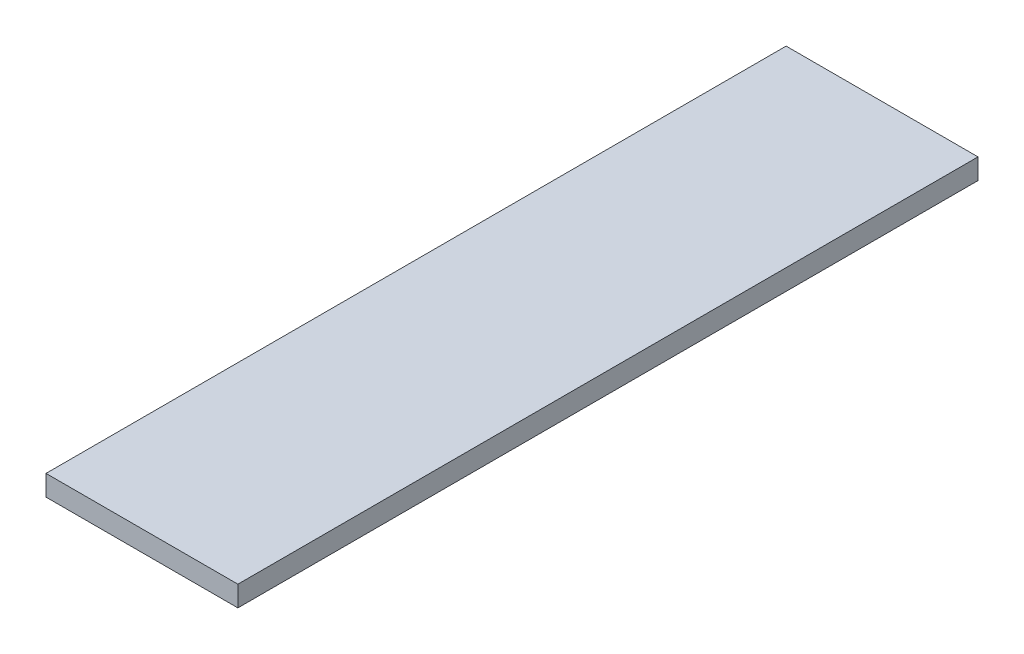
ISO-10303-21;
HEADER;
FILE_DESCRIPTION(('STEP AP214'),'2;1');
FILE_NAME('part.step','',(''),(''),'','','');
FILE_SCHEMA(('AUTOMOTIVE_DESIGN { 1 0 10303 214 1 1 1 1 }'));
ENDSEC;
DATA;
#1=APPLICATION_CONTEXT('core data for automotive mechanical design processes');
#2=APPLICATION_PROTOCOL_DEFINITION('international standard','automotive_design',2000,#1);
#3=PRODUCT_CONTEXT('',#1,'mechanical');
#4=PRODUCT('Part','Part','',(#3));
#5=PRODUCT_RELATED_PRODUCT_CATEGORY('part','',(#4));
#6=PRODUCT_DEFINITION_FORMATION('','',#4);
#7=PRODUCT_DEFINITION_CONTEXT('part definition',#1,'design');
#8=PRODUCT_DEFINITION('design','',#6,#7);
#9=PRODUCT_DEFINITION_SHAPE('','',#8);
#10=(LENGTH_UNIT() NAMED_UNIT(*) SI_UNIT(.MILLI.,.METRE.));
#11=(NAMED_UNIT(*) PLANE_ANGLE_UNIT() SI_UNIT($,.RADIAN.));
#12=(NAMED_UNIT(*) SI_UNIT($,.STERADIAN.) SOLID_ANGLE_UNIT());
#13=UNCERTAINTY_MEASURE_WITH_UNIT(LENGTH_MEASURE(1.E-05),#10,'distance_accuracy_value','');
#14=(GEOMETRIC_REPRESENTATION_CONTEXT(3) GLOBAL_UNCERTAINTY_ASSIGNED_CONTEXT((#13)) GLOBAL_UNIT_ASSIGNED_CONTEXT((#10,
#11,#12)) REPRESENTATION_CONTEXT('',''));
#15=CARTESIAN_POINT('',(0.,0.,0.));
#16=DIRECTION('',(0.,0.,1.));
#17=DIRECTION('',(1.,0.,0.));
#18=AXIS2_PLACEMENT_3D('',#15,#16,#17);
#19=CARTESIAN_POINT('',(88.8999999999999,19.05,-342.9));
#20=DIRECTION('',(-1.,0.,0.));
#21=DIRECTION('',(0.,0.,1.));
#22=AXIS2_PLACEMENT_3D('',#19,#20,#21);
#23=PLANE('',#22);
#24=DIRECTION('',(0.,0.,-1.));
#25=VECTOR('',#24,1.);
#26=CARTESIAN_POINT('',(88.8999999999999,0.,-342.9));
#27=LINE('',#26,#25);
#28=CARTESIAN_POINT('',(88.9,0.,342.9));
#29=VERTEX_POINT('',#28);
#30=CARTESIAN_POINT('',(88.8999999999999,0.,-342.9));
#31=VERTEX_POINT('',#30);
#32=EDGE_CURVE('E97',#29,#31,#27,.T.);
#33=ORIENTED_EDGE('',*,*,#32,.T.);
#34=DIRECTION('',(0.,-1.,0.));
#35=VECTOR('',#34,1.);
#36=CARTESIAN_POINT('',(88.8999999999999,19.05,-342.9));
#37=LINE('',#36,#35);
#38=CARTESIAN_POINT('',(88.8999999999999,19.05,-342.9));
#39=VERTEX_POINT('',#38);
#40=EDGE_CURVE('E11',#39,#31,#37,.T.);
#41=ORIENTED_EDGE('',*,*,#40,.F.);
#42=DIRECTION('',(0.,0.,-1.));
#43=VECTOR('',#42,1.);
#44=CARTESIAN_POINT('',(88.8999999999999,19.05,-342.9));
#45=LINE('',#44,#43);
#46=CARTESIAN_POINT('',(88.9,19.05,342.9));
#47=VERTEX_POINT('',#46);
#48=EDGE_CURVE('E85',#47,#39,#45,.T.);
#49=ORIENTED_EDGE('',*,*,#48,.F.);
#50=DIRECTION('',(0.,-1.,0.));
#51=VECTOR('',#50,1.);
#52=CARTESIAN_POINT('',(88.9,19.05,342.9));
#53=LINE('',#52,#51);
#54=EDGE_CURVE('E93',#47,#29,#53,.T.);
#55=ORIENTED_EDGE('',*,*,#54,.T.);
#56=EDGE_LOOP('',(#33,#41,#49,#55));
#57=FACE_BOUND('',#56,.T.);
#58=ADVANCED_FACE('F34',(#57),#23,.F.);
#59=CARTESIAN_POINT('',(-88.9,19.05,-342.9));
#60=DIRECTION('',(0.,0.,1.));
#61=DIRECTION('',(1.,0.,0.));
#62=AXIS2_PLACEMENT_3D('',#59,#60,#61);
#63=PLANE('',#62);
#64=DIRECTION('',(-1.,0.,0.));
#65=VECTOR('',#64,1.);
#66=CARTESIAN_POINT('',(-88.9,0.,-342.9));
#67=LINE('',#66,#65);
#68=CARTESIAN_POINT('',(-88.9,0.,-342.9));
#69=VERTEX_POINT('',#68);
#70=EDGE_CURVE('E89',#31,#69,#67,.T.);
#71=ORIENTED_EDGE('',*,*,#70,.T.);
#72=DIRECTION('',(0.,-1.,0.));
#73=VECTOR('',#72,1.);
#74=CARTESIAN_POINT('',(-88.9,19.05,-342.9));
#75=LINE('',#74,#73);
#76=CARTESIAN_POINT('',(-88.9,19.05,-342.9));
#77=VERTEX_POINT('',#76);
#78=EDGE_CURVE('E42',#77,#69,#75,.T.);
#79=ORIENTED_EDGE('',*,*,#78,.F.);
#80=DIRECTION('',(-1.,0.,0.));
#81=VECTOR('',#80,1.);
#82=CARTESIAN_POINT('',(-88.9,19.05,-342.9));
#83=LINE('',#82,#81);
#84=EDGE_CURVE('E80',#39,#77,#83,.T.);
#85=ORIENTED_EDGE('',*,*,#84,.F.);
#86=ORIENTED_EDGE('',*,*,#40,.T.);
#87=EDGE_LOOP('',(#71,#79,#85,#86));
#88=FACE_BOUND('',#87,.T.);
#89=ADVANCED_FACE('F88',(#88),#63,.F.);
#90=CARTESIAN_POINT('',(-88.9,19.05,-342.9));
#91=DIRECTION('',(1.,0.,0.));
#92=DIRECTION('',(0.,0.,-1.));
#93=AXIS2_PLACEMENT_3D('',#90,#91,#92);
#94=PLANE('',#93);
#95=DIRECTION('',(0.,0.,1.));
#96=VECTOR('',#95,1.);
#97=CARTESIAN_POINT('',(-88.9,0.,-342.9));
#98=LINE('',#97,#96);
#99=CARTESIAN_POINT('',(-88.8999999999999,0.,342.9));
#100=VERTEX_POINT('',#99);
#101=EDGE_CURVE('E67',#69,#100,#98,.T.);
#102=ORIENTED_EDGE('',*,*,#101,.T.);
#103=DIRECTION('',(0.,-1.,0.));
#104=VECTOR('',#103,1.);
#105=CARTESIAN_POINT('',(-88.8999999999999,19.05,342.9));
#106=LINE('',#105,#104);
#107=CARTESIAN_POINT('',(-88.8999999999999,19.05,342.9));
#108=VERTEX_POINT('',#107);
#109=EDGE_CURVE('E90',#108,#100,#106,.T.);
#110=ORIENTED_EDGE('',*,*,#109,.F.);
#111=DIRECTION('',(0.,0.,1.));
#112=VECTOR('',#111,1.);
#113=CARTESIAN_POINT('',(-88.9,19.05,-342.9));
#114=LINE('',#113,#112);
#115=EDGE_CURVE('E83',#77,#108,#114,.T.);
#116=ORIENTED_EDGE('',*,*,#115,.F.);
#117=ORIENTED_EDGE('',*,*,#78,.T.);
#118=EDGE_LOOP('',(#102,#110,#116,#117));
#119=FACE_BOUND('',#118,.T.);
#120=ADVANCED_FACE('F91',(#119),#94,.F.);
#121=CARTESIAN_POINT('',(-88.8999999999999,19.05,342.9));
#122=DIRECTION('',(0.,0.,-1.));
#123=DIRECTION('',(-1.,0.,0.));
#124=AXIS2_PLACEMENT_3D('',#121,#122,#123);
#125=PLANE('',#124);
#126=DIRECTION('',(1.,0.,0.));
#127=VECTOR('',#126,1.);
#128=CARTESIAN_POINT('',(-88.8999999999999,0.,342.9));
#129=LINE('',#128,#127);
#130=EDGE_CURVE('E73',#100,#29,#129,.T.);
#131=ORIENTED_EDGE('',*,*,#130,.T.);
#132=ORIENTED_EDGE('',*,*,#54,.F.);
#133=DIRECTION('',(1.,0.,0.));
#134=VECTOR('',#133,1.);
#135=CARTESIAN_POINT('',(-88.8999999999999,19.05,342.9));
#136=LINE('',#135,#134);
#137=EDGE_CURVE('E50',#108,#47,#136,.T.);
#138=ORIENTED_EDGE('',*,*,#137,.F.);
#139=ORIENTED_EDGE('',*,*,#109,.T.);
#140=EDGE_LOOP('',(#131,#132,#138,#139));
#141=FACE_BOUND('',#140,.T.);
#142=ADVANCED_FACE('F104',(#141),#125,.F.);
#143=CARTESIAN_POINT('',(88.9,19.05,342.9));
#144=DIRECTION('',(0.,1.,0.));
#145=DIRECTION('',(0.,0.,1.));
#146=AXIS2_PLACEMENT_3D('',#143,#144,#145);
#147=PLANE('',#146);
#148=ORIENTED_EDGE('',*,*,#48,.T.);
#149=ORIENTED_EDGE('',*,*,#84,.T.);
#150=ORIENTED_EDGE('',*,*,#115,.T.);
#151=ORIENTED_EDGE('',*,*,#137,.T.);
#152=EDGE_LOOP('',(#148,#149,#150,#151));
#153=FACE_BOUND('',#152,.T.);
#154=ADVANCED_FACE('F81',(#153),#147,.T.);
#155=CARTESIAN_POINT('',(88.9,0.,342.9));
#156=DIRECTION('',(0.,1.,0.));
#157=DIRECTION('',(0.,0.,1.));
#158=AXIS2_PLACEMENT_3D('',#155,#156,#157);
#159=PLANE('',#158);
#160=ORIENTED_EDGE('',*,*,#32,.F.);
#161=ORIENTED_EDGE('',*,*,#130,.F.);
#162=ORIENTED_EDGE('',*,*,#101,.F.);
#163=ORIENTED_EDGE('',*,*,#70,.F.);
#164=EDGE_LOOP('',(#160,#161,#162,#163));
#165=FACE_BOUND('',#164,.T.);
#166=ADVANCED_FACE('F107',(#165),#159,.F.);
#167=CLOSED_SHELL('',(#58,#89,#120,#142,#154,#166));
#168=MANIFOLD_SOLID_BREP('B2',#167);
#169=ADVANCED_BREP_SHAPE_REPRESENTATION('',(#18,#168),#14);
#170=SHAPE_DEFINITION_REPRESENTATION(#9,#169);
ENDSEC;
END-ISO-10303-21;
